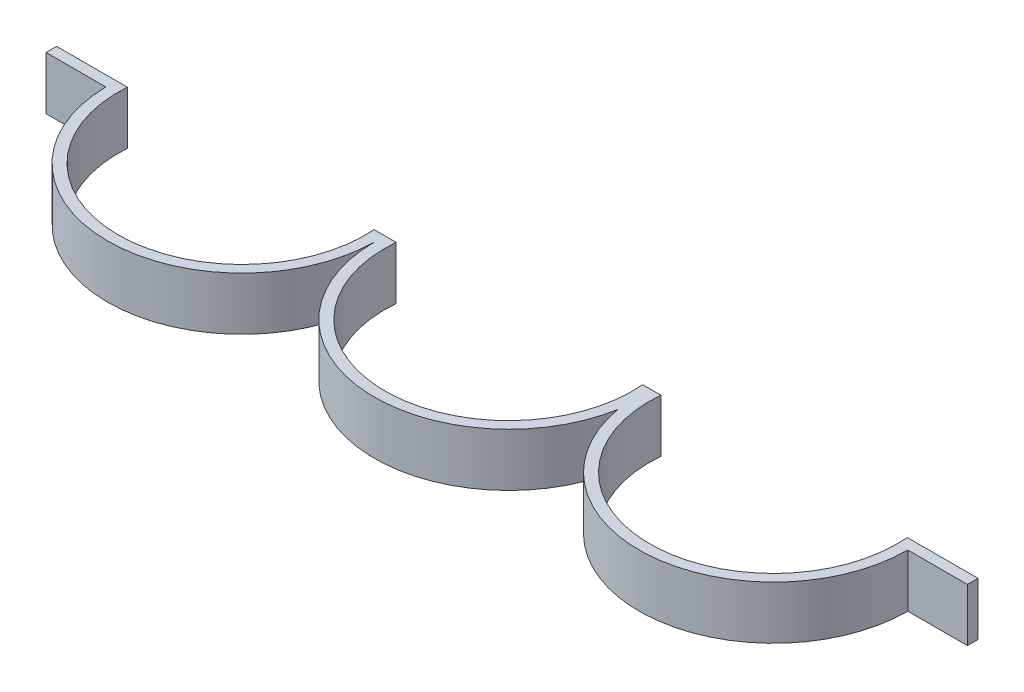
ISO-10303-21;
HEADER;
FILE_DESCRIPTION(('STEP AP214'),'2;1');
FILE_NAME('part.step','',(''),(''),'','','');
FILE_SCHEMA(('AUTOMOTIVE_DESIGN { 1 0 10303 214 1 1 1 1 }'));
ENDSEC;
DATA;
#1=APPLICATION_CONTEXT('core data for automotive mechanical design processes');
#2=APPLICATION_PROTOCOL_DEFINITION('international standard','automotive_design',2000,#1);
#3=PRODUCT_CONTEXT('',#1,'mechanical');
#4=PRODUCT('Part','Part','',(#3));
#5=PRODUCT_RELATED_PRODUCT_CATEGORY('part','',(#4));
#6=PRODUCT_DEFINITION_FORMATION('','',#4);
#7=PRODUCT_DEFINITION_CONTEXT('part definition',#1,'design');
#8=PRODUCT_DEFINITION('design','',#6,#7);
#9=PRODUCT_DEFINITION_SHAPE('','',#8);
#10=(LENGTH_UNIT() NAMED_UNIT(*) SI_UNIT(.MILLI.,.METRE.));
#11=(NAMED_UNIT(*) PLANE_ANGLE_UNIT() SI_UNIT($,.RADIAN.));
#12=(NAMED_UNIT(*) SI_UNIT($,.STERADIAN.) SOLID_ANGLE_UNIT());
#13=UNCERTAINTY_MEASURE_WITH_UNIT(LENGTH_MEASURE(1.E-05),#10,'distance_accuracy_value','');
#14=(GEOMETRIC_REPRESENTATION_CONTEXT(3) GLOBAL_UNCERTAINTY_ASSIGNED_CONTEXT((#13)) GLOBAL_UNIT_ASSIGNED_CONTEXT((#10,
#11,#12)) REPRESENTATION_CONTEXT('',''));
#15=CARTESIAN_POINT('',(0.,0.,0.));
#16=DIRECTION('',(0.,0.,1.));
#17=DIRECTION('',(1.,0.,0.));
#18=AXIS2_PLACEMENT_3D('',#15,#16,#17);
#19=CARTESIAN_POINT('',(-151.992790500959,30.,-1.04680078205298));
#20=DIRECTION('',(0.,-1.,0.));
#21=DIRECTION('',(0.,0.,-1.));
#22=AXIS2_PLACEMENT_3D('',#19,#20,#21);
#23=CYLINDRICAL_SURFACE('',#22,76.);
#24=CARTESIAN_POINT('',(-151.992790500959,0.,-1.04680078205298));
#25=DIRECTION('',(0.,1.,0.));
#26=DIRECTION('',(0.,0.,-1.));
#27=AXIS2_PLACEMENT_3D('',#24,#25,#26);
#28=CIRCLE('',#27,76.);
#29=CARTESIAN_POINT('',(-227.985581001919,0.,0.));
#30=VERTEX_POINT('',#29);
#31=CARTESIAN_POINT('',(-76.,0.,0.));
#32=VERTEX_POINT('',#31);
#33=EDGE_CURVE('E167',#30,#32,#28,.T.);
#34=ORIENTED_EDGE('',*,*,#33,.T.);
#35=DIRECTION('',(0.,-1.,0.));
#36=VECTOR('',#35,1.);
#37=CARTESIAN_POINT('',(-76.,30.,0.));
#38=LINE('',#37,#36);
#39=CARTESIAN_POINT('',(-76.,30.,0.));
#40=VERTEX_POINT('',#39);
#41=EDGE_CURVE('E11',#40,#32,#38,.T.);
#42=ORIENTED_EDGE('',*,*,#41,.F.);
#43=CARTESIAN_POINT('',(-151.992790500959,30.,-1.04680078205298));
#44=DIRECTION('',(0.,1.,0.));
#45=DIRECTION('',(0.,0.,-1.));
#46=AXIS2_PLACEMENT_3D('',#43,#44,#45);
#47=CIRCLE('',#46,76.);
#48=CARTESIAN_POINT('',(-227.985581001919,30.,0.));
#49=VERTEX_POINT('',#48);
#50=EDGE_CURVE('E193',#49,#40,#47,.T.);
#51=ORIENTED_EDGE('',*,*,#50,.F.);
#52=DIRECTION('',(0.,-1.,0.));
#53=VECTOR('',#52,1.);
#54=CARTESIAN_POINT('',(-227.985581001919,30.,0.));
#55=LINE('',#54,#53);
#56=EDGE_CURVE('E163',#49,#30,#55,.T.);
#57=ORIENTED_EDGE('',*,*,#56,.T.);
#58=EDGE_LOOP('',(#34,#42,#51,#57));
#59=FACE_BOUND('',#58,.T.);
#60=ADVANCED_FACE('F35',(#59),#23,.T.);
#61=CARTESIAN_POINT('',(0.,30.,0.));
#62=DIRECTION('',(0.,-1.,0.));
#63=DIRECTION('',(0.,0.,-1.));
#64=AXIS2_PLACEMENT_3D('',#61,#62,#63);
#65=CYLINDRICAL_SURFACE('',#64,76.);
#66=CARTESIAN_POINT('',(0.,0.,0.));
#67=DIRECTION('',(0.,1.,0.));
#68=DIRECTION('',(0.,0.,1.));
#69=AXIS2_PLACEMENT_3D('',#66,#67,#68);
#70=CIRCLE('',#69,76.);
#71=CARTESIAN_POINT('',(74.8804987858664,0.,12.9965726858994));
#72=VERTEX_POINT('',#71);
#73=EDGE_CURVE('E170',#32,#72,#70,.T.);
#74=ORIENTED_EDGE('',*,*,#73,.T.);
#75=DIRECTION('',(0.,-1.,0.));
#76=VECTOR('',#75,1.);
#77=CARTESIAN_POINT('',(74.8804987858664,30.,12.9965726858994));
#78=LINE('',#77,#76);
#79=CARTESIAN_POINT('',(74.8804987858664,30.,12.9965726858994));
#80=VERTEX_POINT('',#79);
#81=EDGE_CURVE('E43',#80,#72,#78,.T.);
#82=ORIENTED_EDGE('',*,*,#81,.F.);
#83=CARTESIAN_POINT('',(0.,30.,0.));
#84=DIRECTION('',(0.,1.,0.));
#85=DIRECTION('',(0.,0.,1.));
#86=AXIS2_PLACEMENT_3D('',#83,#84,#85);
#87=CIRCLE('',#86,76.);
#88=EDGE_CURVE('E112',#40,#80,#87,.T.);
#89=ORIENTED_EDGE('',*,*,#88,.F.);
#90=ORIENTED_EDGE('',*,*,#41,.T.);
#91=EDGE_LOOP('',(#74,#82,#89,#90));
#92=FACE_BOUND('',#91,.T.);
#93=ADVANCED_FACE('F281',(#92),#65,.T.);
#94=CARTESIAN_POINT('',(149.760997571733,30.,0.));
#95=DIRECTION('',(0.,-1.,0.));
#96=DIRECTION('',(0.,0.,-1.));
#97=AXIS2_PLACEMENT_3D('',#94,#95,#96);
#98=CYLINDRICAL_SURFACE('',#97,76.);
#99=CARTESIAN_POINT('',(149.760997571733,0.,0.));
#100=DIRECTION('',(0.,1.,0.));
#101=DIRECTION('',(0.,0.,1.));
#102=AXIS2_PLACEMENT_3D('',#99,#100,#101);
#103=CIRCLE('',#102,76.);
#104=CARTESIAN_POINT('',(225.760997571733,0.,0.));
#105=VERTEX_POINT('',#104);
#106=EDGE_CURVE('E172',#72,#105,#103,.T.);
#107=ORIENTED_EDGE('',*,*,#106,.T.);
#108=DIRECTION('',(0.,-1.,0.));
#109=VECTOR('',#108,1.);
#110=CARTESIAN_POINT('',(225.760997571733,30.,0.));
#111=LINE('',#110,#109);
#112=CARTESIAN_POINT('',(225.760997571733,30.,0.));
#113=VERTEX_POINT('',#112);
#114=EDGE_CURVE('E218',#113,#105,#111,.T.);
#115=ORIENTED_EDGE('',*,*,#114,.F.);
#116=CARTESIAN_POINT('',(149.760997571733,30.,0.));
#117=DIRECTION('',(0.,1.,0.));
#118=DIRECTION('',(0.,0.,1.));
#119=AXIS2_PLACEMENT_3D('',#116,#117,#118);
#120=CIRCLE('',#119,76.);
#121=EDGE_CURVE('E226',#80,#113,#120,.T.);
#122=ORIENTED_EDGE('',*,*,#121,.F.);
#123=ORIENTED_EDGE('',*,*,#81,.T.);
#124=EDGE_LOOP('',(#107,#115,#122,#123));
#125=FACE_BOUND('',#124,.T.);
#126=ADVANCED_FACE('F224',(#125),#98,.T.);
#127=CARTESIAN_POINT('',(225.760997571733,30.,0.));
#128=DIRECTION('',(0.,0.,-1.));
#129=DIRECTION('',(-1.,0.,0.));
#130=AXIS2_PLACEMENT_3D('',#127,#128,#129);
#131=PLANE('',#130);
#132=DIRECTION('',(1.,0.,0.));
#133=VECTOR('',#132,1.);
#134=CARTESIAN_POINT('',(225.760997571733,0.,0.));
#135=LINE('',#134,#133);
#136=CARTESIAN_POINT('',(259.503380668383,0.,0.));
#137=VERTEX_POINT('',#136);
#138=EDGE_CURVE('E174',#105,#137,#135,.T.);
#139=ORIENTED_EDGE('',*,*,#138,.T.);
#140=DIRECTION('',(0.,-1.,0.));
#141=VECTOR('',#140,1.);
#142=CARTESIAN_POINT('',(259.503380668383,30.,0.));
#143=LINE('',#142,#141);
#144=CARTESIAN_POINT('',(259.503380668383,30.,0.));
#145=VERTEX_POINT('',#144);
#146=EDGE_CURVE('E215',#145,#137,#143,.T.);
#147=ORIENTED_EDGE('',*,*,#146,.F.);
#148=DIRECTION('',(1.,0.,0.));
#149=VECTOR('',#148,1.);
#150=CARTESIAN_POINT('',(225.760997571733,30.,0.));
#151=LINE('',#150,#149);
#152=EDGE_CURVE('E244',#113,#145,#151,.T.);
#153=ORIENTED_EDGE('',*,*,#152,.F.);
#154=ORIENTED_EDGE('',*,*,#114,.T.);
#155=EDGE_LOOP('',(#139,#147,#153,#154));
#156=FACE_BOUND('',#155,.T.);
#157=ADVANCED_FACE('F235',(#156),#131,.F.);
#158=CARTESIAN_POINT('',(259.503380668383,30.,0.));
#159=DIRECTION('',(-1.,0.,0.));
#160=DIRECTION('',(0.,0.,1.));
#161=AXIS2_PLACEMENT_3D('',#158,#159,#160);
#162=PLANE('',#161);
#163=DIRECTION('',(0.,0.,-1.));
#164=VECTOR('',#163,1.);
#165=CARTESIAN_POINT('',(259.503380668383,0.,0.));
#166=LINE('',#165,#164);
#167=CARTESIAN_POINT('',(259.503380668383,0.,-6.));
#168=VERTEX_POINT('',#167);
#169=EDGE_CURVE('E176',#137,#168,#166,.T.);
#170=ORIENTED_EDGE('',*,*,#169,.T.);
#171=DIRECTION('',(0.,-1.,0.));
#172=VECTOR('',#171,1.);
#173=CARTESIAN_POINT('',(259.503380668383,30.,-6.));
#174=LINE('',#173,#172);
#175=CARTESIAN_POINT('',(259.503380668383,30.,-6.));
#176=VERTEX_POINT('',#175);
#177=EDGE_CURVE('E212',#176,#168,#174,.T.);
#178=ORIENTED_EDGE('',*,*,#177,.F.);
#179=DIRECTION('',(0.,0.,-1.));
#180=VECTOR('',#179,1.);
#181=CARTESIAN_POINT('',(259.503380668383,30.,0.));
#182=LINE('',#181,#180);
#183=EDGE_CURVE('E241',#145,#176,#182,.T.);
#184=ORIENTED_EDGE('',*,*,#183,.F.);
#185=ORIENTED_EDGE('',*,*,#146,.T.);
#186=EDGE_LOOP('',(#170,#178,#184,#185));
#187=FACE_BOUND('',#186,.T.);
#188=ADVANCED_FACE('F239',(#187),#162,.F.);
#189=CARTESIAN_POINT('',(219.503380668383,30.,-6.));
#190=DIRECTION('',(0.,0.,1.));
#191=DIRECTION('',(1.,0.,0.));
#192=AXIS2_PLACEMENT_3D('',#189,#190,#191);
#193=PLANE('',#192);
#194=DIRECTION('',(-1.,0.,0.));
#195=VECTOR('',#194,1.);
#196=CARTESIAN_POINT('',(219.503380668383,0.,-6.));
#197=LINE('',#196,#195);
#198=CARTESIAN_POINT('',(219.503380668383,0.,-6.));
#199=VERTEX_POINT('',#198);
#200=EDGE_CURVE('E178',#168,#199,#197,.T.);
#201=ORIENTED_EDGE('',*,*,#200,.T.);
#202=DIRECTION('',(0.,-1.,0.));
#203=VECTOR('',#202,1.);
#204=CARTESIAN_POINT('',(219.503380668383,30.,-6.));
#205=LINE('',#204,#203);
#206=CARTESIAN_POINT('',(219.503380668383,30.,-6.));
#207=VERTEX_POINT('',#206);
#208=EDGE_CURVE('E209',#207,#199,#205,.T.);
#209=ORIENTED_EDGE('',*,*,#208,.F.);
#210=DIRECTION('',(-1.,0.,0.));
#211=VECTOR('',#210,1.);
#212=CARTESIAN_POINT('',(219.503380668383,30.,-6.));
#213=LINE('',#212,#211);
#214=EDGE_CURVE('E243',#176,#207,#213,.T.);
#215=ORIENTED_EDGE('',*,*,#214,.F.);
#216=ORIENTED_EDGE('',*,*,#177,.T.);
#217=EDGE_LOOP('',(#201,#209,#215,#216));
#218=FACE_BOUND('',#217,.T.);
#219=ADVANCED_FACE('F294',(#218),#193,.F.);
#220=CARTESIAN_POINT('',(149.760997571733,30.,0.));
#221=DIRECTION('',(0.,-1.,0.));
#222=DIRECTION('',(0.,0.,-1.));
#223=AXIS2_PLACEMENT_3D('',#220,#221,#222);
#224=CYLINDRICAL_SURFACE('',#223,70.);
#225=CARTESIAN_POINT('',(149.760997571733,0.,0.));
#226=DIRECTION('',(0.,-1.,0.));
#227=DIRECTION('',(0.,0.,1.));
#228=AXIS2_PLACEMENT_3D('',#225,#226,#227);
#229=CIRCLE('',#228,70.);
#230=CARTESIAN_POINT('',(80.0186144750819,0.,-5.99999999999999));
#231=VERTEX_POINT('',#230);
#232=EDGE_CURVE('E180',#199,#231,#229,.T.);
#233=ORIENTED_EDGE('',*,*,#232,.T.);
#234=DIRECTION('',(0.,-1.,0.));
#235=VECTOR('',#234,1.);
#236=CARTESIAN_POINT('',(80.0186144750819,30.,-5.99999999999999));
#237=LINE('',#236,#235);
#238=CARTESIAN_POINT('',(80.0186144750819,30.,-5.99999999999999));
#239=VERTEX_POINT('',#238);
#240=EDGE_CURVE('E206',#239,#231,#237,.T.);
#241=ORIENTED_EDGE('',*,*,#240,.F.);
#242=CARTESIAN_POINT('',(149.760997571733,30.,0.));
#243=DIRECTION('',(0.,-1.,0.));
#244=DIRECTION('',(0.,0.,1.));
#245=AXIS2_PLACEMENT_3D('',#242,#243,#244);
#246=CIRCLE('',#245,70.);
#247=EDGE_CURVE('E246',#207,#239,#246,.T.);
#248=ORIENTED_EDGE('',*,*,#247,.F.);
#249=ORIENTED_EDGE('',*,*,#208,.T.);
#250=EDGE_LOOP('',(#233,#241,#248,#249));
#251=FACE_BOUND('',#250,.T.);
#252=ADVANCED_FACE('F297',(#251),#224,.F.);
#253=CARTESIAN_POINT('',(69.7423830966508,30.,-6.));
#254=DIRECTION('',(0.,0.,1.));
#255=DIRECTION('',(1.,0.,0.));
#256=AXIS2_PLACEMENT_3D('',#253,#254,#255);
#257=PLANE('',#256);
#258=DIRECTION('',(-1.,0.,0.));
#259=VECTOR('',#258,1.);
#260=CARTESIAN_POINT('',(69.7423830966508,0.,-6.));
#261=LINE('',#260,#259);
#262=CARTESIAN_POINT('',(69.7423830966508,0.,-6.));
#263=VERTEX_POINT('',#262);
#264=EDGE_CURVE('E182',#231,#263,#261,.T.);
#265=ORIENTED_EDGE('',*,*,#264,.T.);
#266=DIRECTION('',(0.,-1.,0.));
#267=VECTOR('',#266,1.);
#268=CARTESIAN_POINT('',(69.7423830966508,30.,-6.));
#269=LINE('',#268,#267);
#270=CARTESIAN_POINT('',(69.7423830966508,30.,-6.));
#271=VERTEX_POINT('',#270);
#272=EDGE_CURVE('E203',#271,#263,#269,.T.);
#273=ORIENTED_EDGE('',*,*,#272,.F.);
#274=DIRECTION('',(-1.,0.,0.));
#275=VECTOR('',#274,1.);
#276=CARTESIAN_POINT('',(69.7423830966508,30.,-6.));
#277=LINE('',#276,#275);
#278=EDGE_CURVE('E252',#239,#271,#277,.T.);
#279=ORIENTED_EDGE('',*,*,#278,.F.);
#280=ORIENTED_EDGE('',*,*,#240,.T.);
#281=EDGE_LOOP('',(#265,#273,#279,#280));
#282=FACE_BOUND('',#281,.T.);
#283=ADVANCED_FACE('F301',(#282),#257,.F.);
#284=CARTESIAN_POINT('',(0.,30.,0.));
#285=DIRECTION('',(0.,-1.,0.));
#286=DIRECTION('',(0.,0.,-1.));
#287=AXIS2_PLACEMENT_3D('',#284,#285,#286);
#288=CYLINDRICAL_SURFACE('',#287,70.);
#289=CARTESIAN_POINT('',(0.,0.,0.));
#290=DIRECTION('',(0.,-1.,0.));
#291=DIRECTION('',(0.,0.,1.));
#292=AXIS2_PLACEMENT_3D('',#289,#290,#291);
#293=CIRCLE('',#292,70.);
#294=CARTESIAN_POINT('',(-69.7423830966508,0.,-6.00000000000001));
#295=VERTEX_POINT('',#294);
#296=EDGE_CURVE('E184',#263,#295,#293,.T.);
#297=ORIENTED_EDGE('',*,*,#296,.T.);
#298=DIRECTION('',(0.,-1.,0.));
#299=VECTOR('',#298,1.);
#300=CARTESIAN_POINT('',(-69.7423830966508,30.,-6.00000000000001));
#301=LINE('',#300,#299);
#302=CARTESIAN_POINT('',(-69.7423830966508,30.,-6.00000000000001));
#303=VERTEX_POINT('',#302);
#304=EDGE_CURVE('E200',#303,#295,#301,.T.);
#305=ORIENTED_EDGE('',*,*,#304,.F.);
#306=CARTESIAN_POINT('',(0.,30.,0.));
#307=DIRECTION('',(0.,-1.,0.));
#308=DIRECTION('',(0.,0.,1.));
#309=AXIS2_PLACEMENT_3D('',#306,#307,#308);
#310=CIRCLE('',#309,70.);
#311=EDGE_CURVE('E254',#271,#303,#310,.T.);
#312=ORIENTED_EDGE('',*,*,#311,.F.);
#313=ORIENTED_EDGE('',*,*,#272,.T.);
#314=EDGE_LOOP('',(#297,#305,#312,#313));
#315=FACE_BOUND('',#314,.T.);
#316=ADVANCED_FACE('F305',(#315),#288,.F.);
#317=CARTESIAN_POINT('',(-82.1682545733405,30.,-6.));
#318=DIRECTION('',(0.,0.,1.));
#319=DIRECTION('',(1.,0.,0.));
#320=AXIS2_PLACEMENT_3D('',#317,#318,#319);
#321=PLANE('',#320);
#322=DIRECTION('',(-1.,0.,0.));
#323=VECTOR('',#322,1.);
#324=CARTESIAN_POINT('',(-82.1682545733405,0.,-6.));
#325=LINE('',#324,#323);
#326=CARTESIAN_POINT('',(-82.1682545733405,0.,-6.));
#327=VERTEX_POINT('',#326);
#328=EDGE_CURVE('E186',#295,#327,#325,.T.);
#329=ORIENTED_EDGE('',*,*,#328,.T.);
#330=DIRECTION('',(0.,-1.,0.));
#331=VECTOR('',#330,1.);
#332=CARTESIAN_POINT('',(-82.1682545733405,30.,-6.));
#333=LINE('',#332,#331);
#334=CARTESIAN_POINT('',(-82.1682545733405,30.,-6.));
#335=VERTEX_POINT('',#334);
#336=EDGE_CURVE('E197',#335,#327,#333,.T.);
#337=ORIENTED_EDGE('',*,*,#336,.F.);
#338=DIRECTION('',(-1.,0.,0.));
#339=VECTOR('',#338,1.);
#340=CARTESIAN_POINT('',(-82.1682545733405,30.,-6.));
#341=LINE('',#340,#339);
#342=EDGE_CURVE('E256',#303,#335,#341,.T.);
#343=ORIENTED_EDGE('',*,*,#342,.F.);
#344=ORIENTED_EDGE('',*,*,#304,.T.);
#345=EDGE_LOOP('',(#329,#337,#343,#344));
#346=FACE_BOUND('',#345,.T.);
#347=ADVANCED_FACE('F262',(#346),#321,.F.);
#348=CARTESIAN_POINT('',(-151.992790500959,30.,-1.04680078205298));
#349=DIRECTION('',(0.,-1.,0.));
#350=DIRECTION('',(0.,0.,-1.));
#351=AXIS2_PLACEMENT_3D('',#348,#349,#350);
#352=CYLINDRICAL_SURFACE('',#351,70.);
#353=CARTESIAN_POINT('',(-151.992790500959,0.,-1.04680078205298));
#354=DIRECTION('',(0.,-1.,0.));
#355=DIRECTION('',(0.,0.,1.));
#356=AXIS2_PLACEMENT_3D('',#353,#354,#355);
#357=CIRCLE('',#356,70.);
#358=CARTESIAN_POINT('',(-221.817326428578,0.,-6.00000000000002));
#359=VERTEX_POINT('',#358);
#360=EDGE_CURVE('E188',#327,#359,#357,.T.);
#361=ORIENTED_EDGE('',*,*,#360,.T.);
#362=DIRECTION('',(0.,-1.,0.));
#363=VECTOR('',#362,1.);
#364=CARTESIAN_POINT('',(-221.817326428578,30.,-6.00000000000002));
#365=LINE('',#364,#363);
#366=CARTESIAN_POINT('',(-221.817326428578,30.,-6.00000000000002));
#367=VERTEX_POINT('',#366);
#368=EDGE_CURVE('E158',#367,#359,#365,.T.);
#369=ORIENTED_EDGE('',*,*,#368,.F.);
#370=CARTESIAN_POINT('',(-151.992790500959,30.,-1.04680078205298));
#371=DIRECTION('',(0.,-1.,0.));
#372=DIRECTION('',(0.,0.,1.));
#373=AXIS2_PLACEMENT_3D('',#370,#371,#372);
#374=CIRCLE('',#373,70.);
#375=EDGE_CURVE('E149',#335,#367,#374,.T.);
#376=ORIENTED_EDGE('',*,*,#375,.F.);
#377=ORIENTED_EDGE('',*,*,#336,.T.);
#378=EDGE_LOOP('',(#361,#369,#376,#377));
#379=FACE_BOUND('',#378,.T.);
#380=ADVANCED_FACE('F266',(#379),#352,.F.);
#381=CARTESIAN_POINT('',(-261.817326428578,30.,-6.));
#382=DIRECTION('',(0.,0.,1.));
#383=DIRECTION('',(1.,0.,0.));
#384=AXIS2_PLACEMENT_3D('',#381,#382,#383);
#385=PLANE('',#384);
#386=DIRECTION('',(-1.,0.,0.));
#387=VECTOR('',#386,1.);
#388=CARTESIAN_POINT('',(-261.817326428578,0.,-6.));
#389=LINE('',#388,#387);
#390=CARTESIAN_POINT('',(-261.817326428578,0.,-6.));
#391=VERTEX_POINT('',#390);
#392=EDGE_CURVE('E157',#359,#391,#389,.T.);
#393=ORIENTED_EDGE('',*,*,#392,.T.);
#394=DIRECTION('',(0.,-1.,0.));
#395=VECTOR('',#394,1.);
#396=CARTESIAN_POINT('',(-261.817326428578,30.,-6.));
#397=LINE('',#396,#395);
#398=CARTESIAN_POINT('',(-261.817326428578,30.,-6.));
#399=VERTEX_POINT('',#398);
#400=EDGE_CURVE('E154',#399,#391,#397,.T.);
#401=ORIENTED_EDGE('',*,*,#400,.F.);
#402=DIRECTION('',(-1.,0.,0.));
#403=VECTOR('',#402,1.);
#404=CARTESIAN_POINT('',(-261.817326428578,30.,-6.));
#405=LINE('',#404,#403);
#406=EDGE_CURVE('E143',#367,#399,#405,.T.);
#407=ORIENTED_EDGE('',*,*,#406,.F.);
#408=ORIENTED_EDGE('',*,*,#368,.T.);
#409=EDGE_LOOP('',(#393,#401,#407,#408));
#410=FACE_BOUND('',#409,.T.);
#411=ADVANCED_FACE('F155',(#410),#385,.F.);
#412=CARTESIAN_POINT('',(-261.817326428578,30.,0.));
#413=DIRECTION('',(1.,0.,0.));
#414=DIRECTION('',(0.,0.,-1.));
#415=AXIS2_PLACEMENT_3D('',#412,#413,#414);
#416=PLANE('',#415);
#417=DIRECTION('',(0.,0.,1.));
#418=VECTOR('',#417,1.);
#419=CARTESIAN_POINT('',(-261.817326428578,0.,0.));
#420=LINE('',#419,#418);
#421=CARTESIAN_POINT('',(-261.817326428578,0.,0.));
#422=VERTEX_POINT('',#421);
#423=EDGE_CURVE('E98',#391,#422,#420,.T.);
#424=ORIENTED_EDGE('',*,*,#423,.T.);
#425=DIRECTION('',(0.,-1.,0.));
#426=VECTOR('',#425,1.);
#427=CARTESIAN_POINT('',(-261.817326428578,30.,0.));
#428=LINE('',#427,#426);
#429=CARTESIAN_POINT('',(-261.817326428578,30.,0.));
#430=VERTEX_POINT('',#429);
#431=EDGE_CURVE('E159',#430,#422,#428,.T.);
#432=ORIENTED_EDGE('',*,*,#431,.F.);
#433=DIRECTION('',(0.,0.,1.));
#434=VECTOR('',#433,1.);
#435=CARTESIAN_POINT('',(-261.817326428578,30.,0.));
#436=LINE('',#435,#434);
#437=EDGE_CURVE('E147',#399,#430,#436,.T.);
#438=ORIENTED_EDGE('',*,*,#437,.F.);
#439=ORIENTED_EDGE('',*,*,#400,.T.);
#440=EDGE_LOOP('',(#424,#432,#438,#439));
#441=FACE_BOUND('',#440,.T.);
#442=ADVANCED_FACE('F161',(#441),#416,.F.);
#443=CARTESIAN_POINT('',(-227.985581001919,30.,0.));
#444=DIRECTION('',(0.,0.,-1.));
#445=DIRECTION('',(-1.,0.,0.));
#446=AXIS2_PLACEMENT_3D('',#443,#444,#445);
#447=PLANE('',#446);
#448=DIRECTION('',(1.,0.,0.));
#449=VECTOR('',#448,1.);
#450=CARTESIAN_POINT('',(-227.985581001919,0.,0.));
#451=LINE('',#450,#449);
#452=EDGE_CURVE('E104',#422,#30,#451,.T.);
#453=ORIENTED_EDGE('',*,*,#452,.T.);
#454=ORIENTED_EDGE('',*,*,#56,.F.);
#455=DIRECTION('',(1.,0.,0.));
#456=VECTOR('',#455,1.);
#457=CARTESIAN_POINT('',(-227.985581001919,30.,0.));
#458=LINE('',#457,#456);
#459=EDGE_CURVE('E51',#430,#49,#458,.T.);
#460=ORIENTED_EDGE('',*,*,#459,.F.);
#461=ORIENTED_EDGE('',*,*,#431,.T.);
#462=EDGE_LOOP('',(#453,#454,#460,#461));
#463=FACE_BOUND('',#462,.T.);
#464=ADVANCED_FACE('F270',(#463),#447,.F.);
#465=CARTESIAN_POINT('',(-151.992790500959,30.,-1.04680078205298));
#466=DIRECTION('',(0.,-1.,0.));
#467=DIRECTION('',(0.,0.,-1.));
#468=AXIS2_PLACEMENT_3D('',#465,#466,#467);
#469=PLANE('',#468);
#470=ORIENTED_EDGE('',*,*,#50,.T.);
#471=ORIENTED_EDGE('',*,*,#88,.T.);
#472=ORIENTED_EDGE('',*,*,#121,.T.);
#473=ORIENTED_EDGE('',*,*,#152,.T.);
#474=ORIENTED_EDGE('',*,*,#183,.T.);
#475=ORIENTED_EDGE('',*,*,#214,.T.);
#476=ORIENTED_EDGE('',*,*,#247,.T.);
#477=ORIENTED_EDGE('',*,*,#278,.T.);
#478=ORIENTED_EDGE('',*,*,#311,.T.);
#479=ORIENTED_EDGE('',*,*,#342,.T.);
#480=ORIENTED_EDGE('',*,*,#375,.T.);
#481=ORIENTED_EDGE('',*,*,#406,.T.);
#482=ORIENTED_EDGE('',*,*,#437,.T.);
#483=ORIENTED_EDGE('',*,*,#459,.T.);
#484=EDGE_LOOP('',(#470,#471,#472,#473,#474,#475,#476,#477,#478,#479,#480,#481,#482,#483));
#485=FACE_BOUND('',#484,.T.);
#486=ADVANCED_FACE('F145',(#485),#469,.F.);
#487=CARTESIAN_POINT('',(-151.992790500959,0.,-1.04680078205298));
#488=DIRECTION('',(0.,-1.,0.));
#489=DIRECTION('',(0.,0.,-1.));
#490=AXIS2_PLACEMENT_3D('',#487,#488,#489);
#491=PLANE('',#490);
#492=ORIENTED_EDGE('',*,*,#33,.F.);
#493=ORIENTED_EDGE('',*,*,#452,.F.);
#494=ORIENTED_EDGE('',*,*,#423,.F.);
#495=ORIENTED_EDGE('',*,*,#392,.F.);
#496=ORIENTED_EDGE('',*,*,#360,.F.);
#497=ORIENTED_EDGE('',*,*,#328,.F.);
#498=ORIENTED_EDGE('',*,*,#296,.F.);
#499=ORIENTED_EDGE('',*,*,#264,.F.);
#500=ORIENTED_EDGE('',*,*,#232,.F.);
#501=ORIENTED_EDGE('',*,*,#200,.F.);
#502=ORIENTED_EDGE('',*,*,#169,.F.);
#503=ORIENTED_EDGE('',*,*,#138,.F.);
#504=ORIENTED_EDGE('',*,*,#106,.F.);
#505=ORIENTED_EDGE('',*,*,#73,.F.);
#506=EDGE_LOOP('',(#492,#493,#494,#495,#496,#497,#498,#499,#500,#501,#502,#503,#504,#505));
#507=FACE_BOUND('',#506,.T.);
#508=ADVANCED_FACE('F230',(#507),#491,.T.);
#509=CLOSED_SHELL('',(#60,#93,#126,#157,#188,#219,#252,#283,#316,#347,#380,#411,#442,#464,#486,#508));
#510=MANIFOLD_SOLID_BREP('B2',#509);
#511=ADVANCED_BREP_SHAPE_REPRESENTATION('',(#18,#510),#14);
#512=SHAPE_DEFINITION_REPRESENTATION(#9,#511);
ENDSEC;
END-ISO-10303-21;
